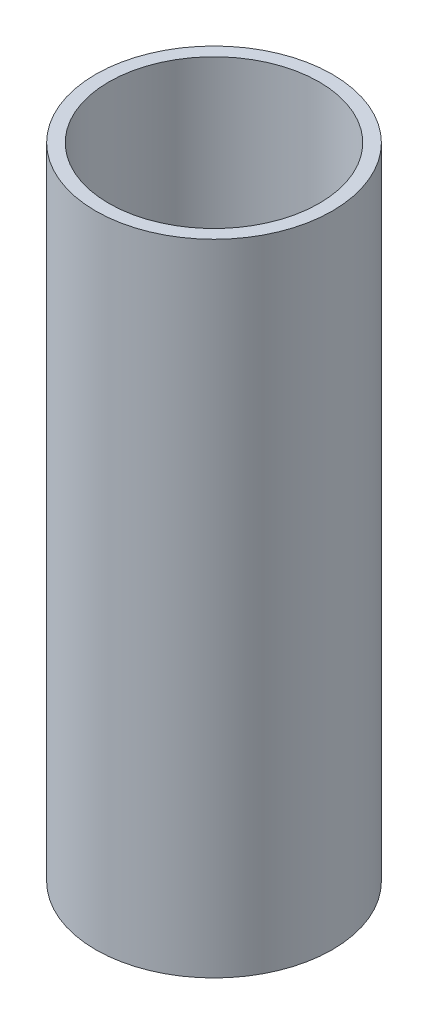
ISO-10303-21;
HEADER;
FILE_DESCRIPTION(('STEP AP214'),'2;1');
FILE_NAME('part.step','',(''),(''),'','','');
FILE_SCHEMA(('AUTOMOTIVE_DESIGN { 1 0 10303 214 1 1 1 1 }'));
ENDSEC;
DATA;
#1=APPLICATION_CONTEXT('core data for automotive mechanical design processes');
#2=APPLICATION_PROTOCOL_DEFINITION('international standard','automotive_design',2000,#1);
#3=PRODUCT_CONTEXT('',#1,'mechanical');
#4=PRODUCT('Part','Part','',(#3));
#5=PRODUCT_RELATED_PRODUCT_CATEGORY('part','',(#4));
#6=PRODUCT_DEFINITION_FORMATION('','',#4);
#7=PRODUCT_DEFINITION_CONTEXT('part definition',#1,'design');
#8=PRODUCT_DEFINITION('design','',#6,#7);
#9=PRODUCT_DEFINITION_SHAPE('','',#8);
#10=(LENGTH_UNIT() NAMED_UNIT(*) SI_UNIT(.MILLI.,.METRE.));
#11=(NAMED_UNIT(*) PLANE_ANGLE_UNIT() SI_UNIT($,.RADIAN.));
#12=(NAMED_UNIT(*) SI_UNIT($,.STERADIAN.) SOLID_ANGLE_UNIT());
#13=UNCERTAINTY_MEASURE_WITH_UNIT(LENGTH_MEASURE(1.E-05),#10,'distance_accuracy_value','');
#14=(GEOMETRIC_REPRESENTATION_CONTEXT(3) GLOBAL_UNCERTAINTY_ASSIGNED_CONTEXT((#13)) GLOBAL_UNIT_ASSIGNED_CONTEXT((#10,
#11,#12)) REPRESENTATION_CONTEXT('',''));
#15=CARTESIAN_POINT('',(0.,0.,0.));
#16=DIRECTION('',(0.,0.,1.));
#17=DIRECTION('',(1.,0.,0.));
#18=AXIS2_PLACEMENT_3D('',#15,#16,#17);
#19=CARTESIAN_POINT('',(0.,1.6,0.));
#20=DIRECTION('',(0.,1.,0.));
#21=DIRECTION('',(0.,0.,1.));
#22=AXIS2_PLACEMENT_3D('',#19,#20,#21);
#23=PLANE('',#22);
#24=CARTESIAN_POINT('',(0.,1.6,0.));
#25=DIRECTION('',(0.,1.,0.));
#26=DIRECTION('',(0.,0.,1.));
#27=AXIS2_PLACEMENT_3D('',#24,#25,#26);
#28=CIRCLE('',#27,6.);
#29=CARTESIAN_POINT('',(0.,1.6,6.));
#30=VERTEX_POINT('',#29);
#31=EDGE_CURVE('E48',#30,#30,#28,.F.);
#32=ORIENTED_EDGE('',*,*,#31,.T.);
#33=EDGE_LOOP('',(#32));
#34=FACE_BOUND('',#33,.T.);
#35=CARTESIAN_POINT('',(0.,1.6,0.));
#36=DIRECTION('',(0.,1.,0.));
#37=DIRECTION('',(0.,0.,1.));
#38=AXIS2_PLACEMENT_3D('',#35,#36,#37);
#39=CIRCLE('',#38,20.);
#40=CARTESIAN_POINT('',(0.,1.6,20.));
#41=VERTEX_POINT('',#40);
#42=EDGE_CURVE('E39',#41,#41,#39,.T.);
#43=ORIENTED_EDGE('',*,*,#42,.T.);
#44=EDGE_LOOP('',(#43));
#45=FACE_BOUND('',#44,.T.);
#46=ADVANCED_FACE('F36',(#34,#45),#23,.T.);
#47=CARTESIAN_POINT('',(0.,1.6,0.));
#48=DIRECTION('',(0.,1.,0.));
#49=DIRECTION('',(0.,0.,1.));
#50=AXIS2_PLACEMENT_3D('',#47,#48,#49);
#51=CYLINDRICAL_SURFACE('',#50,20.);
#52=ORIENTED_EDGE('',*,*,#42,.F.);
#53=EDGE_LOOP('',(#52));
#54=FACE_BOUND('',#53,.T.);
#55=CARTESIAN_POINT('',(0.,121.6,0.));
#56=DIRECTION('',(0.,1.,0.));
#57=DIRECTION('',(0.,0.,1.));
#58=AXIS2_PLACEMENT_3D('',#55,#56,#57);
#59=CIRCLE('',#58,20.);
#60=CARTESIAN_POINT('',(0.,121.6,20.));
#61=VERTEX_POINT('',#60);
#62=EDGE_CURVE('E43',#61,#61,#59,.F.);
#63=ORIENTED_EDGE('',*,*,#62,.F.);
#64=EDGE_LOOP('',(#63));
#65=FACE_BOUND('',#64,.T.);
#66=ADVANCED_FACE('F79',(#54,#65),#51,.F.);
#67=CARTESIAN_POINT('',(0.,0.,0.));
#68=DIRECTION('',(0.,1.,0.));
#69=DIRECTION('',(0.,0.,1.));
#70=AXIS2_PLACEMENT_3D('',#67,#68,#69);
#71=CYLINDRICAL_SURFACE('',#70,6.);
#72=CARTESIAN_POINT('',(0.,0.,0.));
#73=DIRECTION('',(0.,1.,0.));
#74=DIRECTION('',(0.,0.,1.));
#75=AXIS2_PLACEMENT_3D('',#72,#73,#74);
#76=CIRCLE('',#75,6.);
#77=CARTESIAN_POINT('',(0.,0.,6.));
#78=VERTEX_POINT('',#77);
#79=EDGE_CURVE('E11',#78,#78,#76,.F.);
#80=ORIENTED_EDGE('',*,*,#79,.T.);
#81=EDGE_LOOP('',(#80));
#82=FACE_BOUND('',#81,.T.);
#83=ORIENTED_EDGE('',*,*,#31,.F.);
#84=EDGE_LOOP('',(#83));
#85=FACE_BOUND('',#84,.T.);
#86=ADVANCED_FACE('F83',(#82,#85),#71,.F.);
#87=CARTESIAN_POINT('',(0.,121.6,0.));
#88=DIRECTION('',(0.,1.,0.));
#89=DIRECTION('',(0.,0.,1.));
#90=AXIS2_PLACEMENT_3D('',#87,#88,#89);
#91=PLANE('',#90);
#92=ORIENTED_EDGE('',*,*,#62,.T.);
#93=EDGE_LOOP('',(#92));
#94=FACE_BOUND('',#93,.T.);
#95=CARTESIAN_POINT('',(0.,121.6,0.));
#96=DIRECTION('',(0.,1.,0.));
#97=DIRECTION('',(0.,0.,1.));
#98=AXIS2_PLACEMENT_3D('',#95,#96,#97);
#99=CIRCLE('',#98,22.5);
#100=CARTESIAN_POINT('',(0.,121.6,22.5));
#101=VERTEX_POINT('',#100);
#102=EDGE_CURVE('E51',#101,#101,#99,.T.);
#103=ORIENTED_EDGE('',*,*,#102,.T.);
#104=EDGE_LOOP('',(#103));
#105=FACE_BOUND('',#104,.T.);
#106=ADVANCED_FACE('F66',(#94,#105),#91,.T.);
#107=CARTESIAN_POINT('',(0.,0.,0.));
#108=DIRECTION('',(0.,1.,0.));
#109=DIRECTION('',(0.,0.,1.));
#110=AXIS2_PLACEMENT_3D('',#107,#108,#109);
#111=PLANE('',#110);
#112=ORIENTED_EDGE('',*,*,#79,.F.);
#113=EDGE_LOOP('',(#112));
#114=FACE_BOUND('',#113,.T.);
#115=CARTESIAN_POINT('',(0.,0.,0.));
#116=DIRECTION('',(0.,1.,0.));
#117=DIRECTION('',(0.,0.,1.));
#118=AXIS2_PLACEMENT_3D('',#115,#116,#117);
#119=CIRCLE('',#118,22.5);
#120=CARTESIAN_POINT('',(0.,0.,22.5));
#121=VERTEX_POINT('',#120);
#122=EDGE_CURVE('E57',#121,#121,#119,.F.);
#123=ORIENTED_EDGE('',*,*,#122,.T.);
#124=EDGE_LOOP('',(#123));
#125=FACE_BOUND('',#124,.T.);
#126=ADVANCED_FACE('F70',(#114,#125),#111,.F.);
#127=CARTESIAN_POINT('',(0.,-63.6396103067893,0.));
#128=DIRECTION('',(0.,1.,0.));
#129=DIRECTION('',(0.,0.,1.));
#130=AXIS2_PLACEMENT_3D('',#127,#128,#129);
#131=CYLINDRICAL_SURFACE('',#130,22.5);
#132=ORIENTED_EDGE('',*,*,#122,.F.);
#133=EDGE_LOOP('',(#132));
#134=FACE_BOUND('',#133,.T.);
#135=ORIENTED_EDGE('',*,*,#102,.F.);
#136=EDGE_LOOP('',(#135));
#137=FACE_BOUND('',#136,.T.);
#138=ADVANCED_FACE('F68',(#134,#137),#131,.T.);
#139=CLOSED_SHELL('',(#46,#66,#86,#106,#126,#138));
#140=MANIFOLD_SOLID_BREP('B2',#139);
#141=ADVANCED_BREP_SHAPE_REPRESENTATION('',(#18,#140),#14);
#142=SHAPE_DEFINITION_REPRESENTATION(#9,#141);
ENDSEC;
END-ISO-10303-21;
